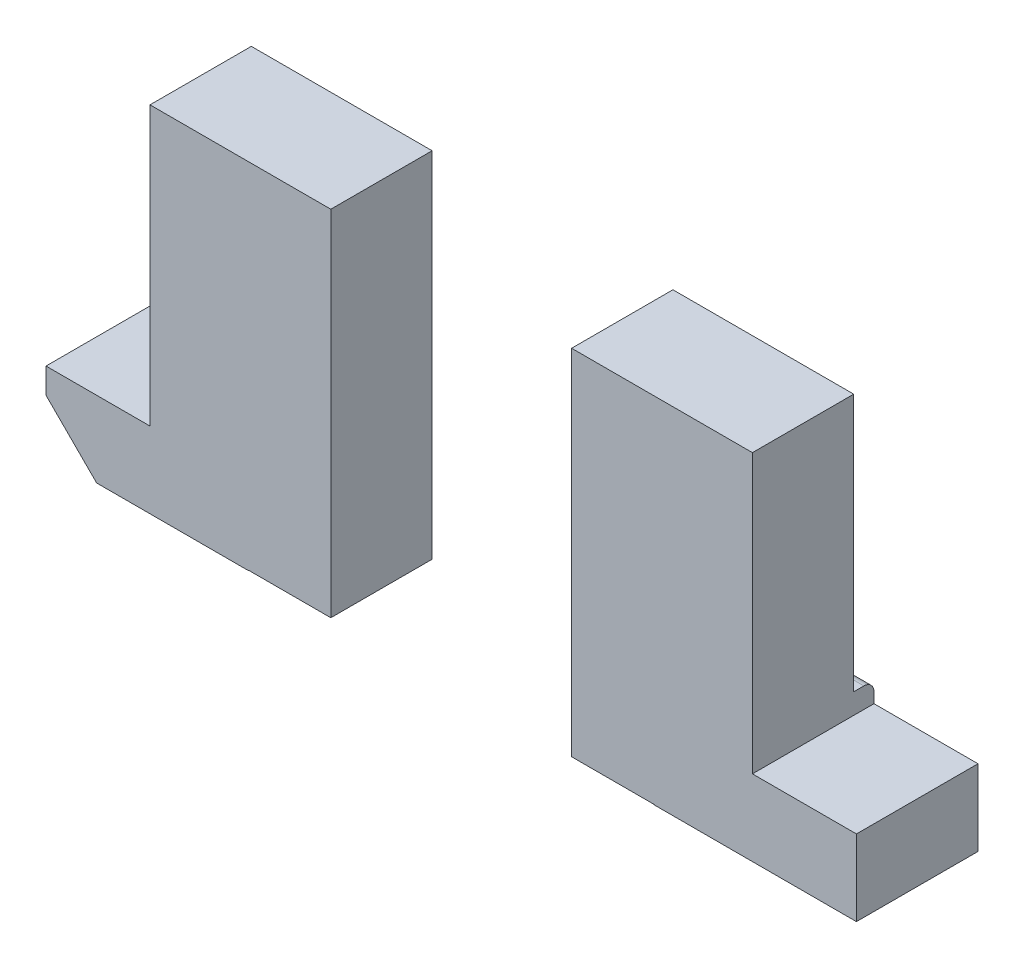
ISO-10303-21;
HEADER;
FILE_DESCRIPTION(('STEP AP214'),'2;1');
FILE_NAME('part.step','',(''),(''),'','','');
FILE_SCHEMA(('AUTOMOTIVE_DESIGN { 1 0 10303 214 1 1 1 1 }'));
ENDSEC;
DATA;
#1=APPLICATION_CONTEXT('core data for automotive mechanical design processes');
#2=APPLICATION_PROTOCOL_DEFINITION('international standard','automotive_design',2000,#1);
#3=PRODUCT_CONTEXT('',#1,'mechanical');
#4=PRODUCT('Part','Part','',(#3));
#5=PRODUCT_RELATED_PRODUCT_CATEGORY('part','',(#4));
#6=PRODUCT_DEFINITION_FORMATION('','',#4);
#7=PRODUCT_DEFINITION_CONTEXT('part definition',#1,'design');
#8=PRODUCT_DEFINITION('design','',#6,#7);
#9=PRODUCT_DEFINITION_SHAPE('','',#8);
#10=(LENGTH_UNIT() NAMED_UNIT(*) SI_UNIT(.MILLI.,.METRE.));
#11=(NAMED_UNIT(*) PLANE_ANGLE_UNIT() SI_UNIT($,.RADIAN.));
#12=(NAMED_UNIT(*) SI_UNIT($,.STERADIAN.) SOLID_ANGLE_UNIT());
#13=UNCERTAINTY_MEASURE_WITH_UNIT(LENGTH_MEASURE(1.E-05),#10,'distance_accuracy_value','');
#14=(GEOMETRIC_REPRESENTATION_CONTEXT(3) GLOBAL_UNCERTAINTY_ASSIGNED_CONTEXT((#13)) GLOBAL_UNIT_ASSIGNED_CONTEXT((#10,
#11,#12)) REPRESENTATION_CONTEXT('',''));
#15=CARTESIAN_POINT('',(0.,0.,0.));
#16=DIRECTION('',(0.,0.,1.));
#17=DIRECTION('',(1.,0.,0.));
#18=AXIS2_PLACEMENT_3D('',#15,#16,#17);
#19=CARTESIAN_POINT('',(-0.8,-0.2,0.));
#20=DIRECTION('',(0.,1.,0.));
#21=DIRECTION('',(1.,0.,0.));
#22=AXIS2_PLACEMENT_3D('',#19,#20,#21);
#23=PLANE('',#22);
#24=DIRECTION('',(1.,0.,0.));
#25=VECTOR('',#24,1.);
#26=CARTESIAN_POINT('',(0.,-0.2,0.02));
#27=LINE('',#26,#25);
#28=CARTESIAN_POINT('',(-0.8,-0.2,0.02));
#29=VERTEX_POINT('',#28);
#30=CARTESIAN_POINT('',(-0.594652416555,-0.2,0.02));
#31=VERTEX_POINT('',#30);
#32=EDGE_CURVE('P0_E237',#29,#31,#27,.T.);
#33=ORIENTED_EDGE('',*,*,#32,.F.);
#34=DIRECTION('',(0.,0.,-1.));
#35=VECTOR('',#34,1.);
#36=CARTESIAN_POINT('',(-0.8,-0.2,0.));
#37=LINE('',#36,#35);
#38=CARTESIAN_POINT('',(-0.8,-0.2,0.26));
#39=VERTEX_POINT('',#38);
#40=EDGE_CURVE('P0_E42',#39,#29,#37,.T.);
#41=ORIENTED_EDGE('',*,*,#40,.F.);
#42=DIRECTION('',(-1.,0.,0.));
#43=VECTOR('',#42,1.);
#44=CARTESIAN_POINT('',(0.,-0.2,0.26));
#45=LINE('',#44,#43);
#46=CARTESIAN_POINT('',(-0.594652416555,-0.2,0.26));
#47=VERTEX_POINT('',#46);
#48=EDGE_CURVE('P0_E227',#47,#39,#45,.T.);
#49=ORIENTED_EDGE('',*,*,#48,.F.);
#50=DIRECTION('',(0.,0.,1.));
#51=VECTOR('',#50,1.);
#52=CARTESIAN_POINT('',(-0.594652416555,-0.2,0.06885270012602));
#53=LINE('',#52,#51);
#54=EDGE_CURVE('P0_E28',#31,#47,#53,.T.);
#55=ORIENTED_EDGE('',*,*,#54,.F.);
#56=EDGE_LOOP('',(#33,#41,#49,#55));
#57=FACE_BOUND('',#56,.T.);
#58=ADVANCED_FACE('P0_F17',(#57),#23,.T.);
#59=CARTESIAN_POINT('',(-0.594652416555,-0.349252516346,0.26));
#60=DIRECTION('',(-1.,0.,0.));
#61=DIRECTION('',(0.,0.,1.));
#62=AXIS2_PLACEMENT_3D('',#59,#60,#61);
#63=PLANE('',#62);
#64=DIRECTION('',(0.,-1.,0.));
#65=VECTOR('',#64,1.);
#66=CARTESIAN_POINT('',(-0.594652416555,-0.129801770078,0.26));
#67=LINE('',#66,#65);
#68=CARTESIAN_POINT('',(-0.594652416555,0.349252516346,0.26));
#69=VERTEX_POINT('',#68);
#70=EDGE_CURVE('P0_E224',#69,#47,#67,.T.);
#71=ORIENTED_EDGE('',*,*,#70,.F.);
#72=DIRECTION('',(0.,0.,-1.));
#73=VECTOR('',#72,1.);
#74=CARTESIAN_POINT('',(-0.594652416555,0.349252516346,0.26));
#75=LINE('',#74,#73);
#76=CARTESIAN_POINT('',(-0.594652416555,0.349252516346,0.06));
#77=VERTEX_POINT('',#76);
#78=EDGE_CURVE('P0_E11',#69,#77,#75,.T.);
#79=ORIENTED_EDGE('',*,*,#78,.T.);
#80=DIRECTION('',(0.,1.,0.));
#81=VECTOR('',#80,1.);
#82=CARTESIAN_POINT('',(-0.594652416555,0.349252516346,0.06));
#83=LINE('',#82,#81);
#84=CARTESIAN_POINT('',(-0.594652416555,-0.159603540156,0.06));
#85=VERTEX_POINT('',#84);
#86=EDGE_CURVE('P0_E183',#85,#77,#83,.T.);
#87=ORIENTED_EDGE('',*,*,#86,.F.);
#88=DIRECTION('',(0.,0.,1.));
#89=VECTOR('',#88,1.);
#90=CARTESIAN_POINT('',(-0.594652416555,-0.159603540156,0.07885270012602));
#91=LINE('',#90,#89);
#92=CARTESIAN_POINT('',(-0.594652416555,-0.159603540156,0.04));
#93=VERTEX_POINT('',#92);
#94=EDGE_CURVE('P0_E206',#93,#85,#91,.T.);
#95=ORIENTED_EDGE('',*,*,#94,.F.);
#96=CARTESIAN_POINT('',(-0.594652416555,-0.179603540156,0.04));
#97=DIRECTION('',(1.,0.,0.));
#98=DIRECTION('',(0.,0.707106781186548,-0.707106781186548));
#99=AXIS2_PLACEMENT_3D('',#96,#97,#98);
#100=CIRCLE('',#99,0.02);
#101=CARTESIAN_POINT('',(-0.594652416555,-0.179603540156,0.02));
#102=VERTEX_POINT('',#101);
#103=EDGE_CURVE('P0_E217',#102,#93,#100,.T.);
#104=ORIENTED_EDGE('',*,*,#103,.F.);
#105=DIRECTION('',(0.,1.,0.));
#106=VECTOR('',#105,1.);
#107=CARTESIAN_POINT('',(-0.594652416555,-0.225,0.02));
#108=LINE('',#107,#106);
#109=EDGE_CURVE('P0_E125',#31,#102,#108,.T.);
#110=ORIENTED_EDGE('',*,*,#109,.F.);
#111=ORIENTED_EDGE('',*,*,#54,.T.);
#112=EDGE_LOOP('',(#71,#79,#87,#95,#104,#110,#111));
#113=FACE_BOUND('',#112,.T.);
#114=ADVANCED_FACE('P0_F285',(#113),#63,.T.);
#115=CARTESIAN_POINT('',(0.8,-0.159603540156,0.26));
#116=DIRECTION('',(0.,0.,1.));
#117=DIRECTION('',(1.,0.,0.));
#118=AXIS2_PLACEMENT_3D('',#115,#116,#117);
#119=PLANE('',#118);
#120=ORIENTED_EDGE('',*,*,#70,.T.);
#121=ORIENTED_EDGE('',*,*,#48,.T.);
#122=DIRECTION('',(0.,-1.,0.));
#123=VECTOR('',#122,1.);
#124=CARTESIAN_POINT('',(-0.8,0.2,0.26));
#125=LINE('',#124,#123);
#126=CARTESIAN_POINT('',(-0.8,-0.25,0.26));
#127=VERTEX_POINT('',#126);
#128=EDGE_CURVE('P0_E274',#39,#127,#125,.T.);
#129=ORIENTED_EDGE('',*,*,#128,.T.);
#130=DIRECTION('',(-0.707106781186548,0.707106781186548,0.));
#131=VECTOR('',#130,1.);
#132=CARTESIAN_POINT('',(-0.712899120865,-0.337100879135,0.26));
#133=LINE('',#132,#131);
#134=CARTESIAN_POINT('',(-0.7,-0.35,0.26));
#135=VERTEX_POINT('',#134);
#136=EDGE_CURVE('P0_E136',#135,#127,#133,.T.);
#137=ORIENTED_EDGE('',*,*,#136,.F.);
#138=DIRECTION('',(-1.,0.,0.));
#139=VECTOR('',#138,1.);
#140=CARTESIAN_POINT('',(-0.7,-0.35,0.26));
#141=LINE('',#140,#139);
#142=CARTESIAN_POINT('',(-0.4,-0.35,0.26));
#143=VERTEX_POINT('',#142);
#144=EDGE_CURVE('P0_E146',#143,#135,#141,.T.);
#145=ORIENTED_EDGE('',*,*,#144,.F.);
#146=DIRECTION('',(0.,1.,0.));
#147=VECTOR('',#146,1.);
#148=CARTESIAN_POINT('',(-0.4,0.172033539864,0.26));
#149=LINE('',#148,#147);
#150=CARTESIAN_POINT('',(-0.4,-0.349252516346,0.26));
#151=VERTEX_POINT('',#150);
#152=EDGE_CURVE('P0_E171',#143,#151,#149,.T.);
#153=ORIENTED_EDGE('',*,*,#152,.T.);
#154=DIRECTION('',(1.,0.,0.));
#155=VECTOR('',#154,1.);
#156=CARTESIAN_POINT('',(-0.594652416555,-0.349252516346,0.26));
#157=LINE('',#156,#155);
#158=CARTESIAN_POINT('',(-0.237707110887,-0.349252516346,0.26));
#159=VERTEX_POINT('',#158);
#160=EDGE_CURVE('P0_E164',#151,#159,#157,.T.);
#161=ORIENTED_EDGE('',*,*,#160,.T.);
#162=DIRECTION('',(0.,1.,0.));
#163=VECTOR('',#162,1.);
#164=CARTESIAN_POINT('',(-0.237707110887,-0.349252516346,0.26));
#165=LINE('',#164,#163);
#166=CARTESIAN_POINT('',(-0.237707110887,0.349252516346,0.26));
#167=VERTEX_POINT('',#166);
#168=EDGE_CURVE('P0_E156',#159,#167,#165,.T.);
#169=ORIENTED_EDGE('',*,*,#168,.T.);
#170=DIRECTION('',(-1.,0.,0.));
#171=VECTOR('',#170,1.);
#172=CARTESIAN_POINT('',(-0.237707110887,0.349252516346,0.26));
#173=LINE('',#172,#171);
#174=EDGE_CURVE('P0_E165',#167,#69,#173,.T.);
#175=ORIENTED_EDGE('',*,*,#174,.T.);
#176=EDGE_LOOP('',(#120,#121,#129,#137,#145,#153,#161,#169,#175));
#177=FACE_BOUND('',#176,.T.);
#178=ADVANCED_FACE('P0_F169',(#177),#119,.T.);
#179=CARTESIAN_POINT('',(-0.237707110887,-0.349252516346,0.26));
#180=DIRECTION('',(0.,-1.,0.));
#181=DIRECTION('',(0.,0.,-1.));
#182=AXIS2_PLACEMENT_3D('',#179,#180,#181);
#183=PLANE('',#182);
#184=DIRECTION('',(0.,0.,1.));
#185=VECTOR('',#184,1.);
#186=CARTESIAN_POINT('',(-0.4,-0.349252516346,0.13));
#187=LINE('',#186,#185);
#188=CARTESIAN_POINT('',(-0.4,-0.349252516346,0.06));
#189=VERTEX_POINT('',#188);
#190=EDGE_CURVE('P0_E67',#189,#151,#187,.T.);
#191=ORIENTED_EDGE('',*,*,#190,.F.);
#192=DIRECTION('',(-1.,0.,0.));
#193=VECTOR('',#192,1.);
#194=CARTESIAN_POINT('',(-0.594652416555,-0.349252516346,0.06));
#195=LINE('',#194,#193);
#196=CARTESIAN_POINT('',(-0.237707110887,-0.349252516346,0.06));
#197=VERTEX_POINT('',#196);
#198=EDGE_CURVE('P0_E21',#197,#189,#195,.T.);
#199=ORIENTED_EDGE('',*,*,#198,.F.);
#200=DIRECTION('',(0.,0.,-1.));
#201=VECTOR('',#200,1.);
#202=CARTESIAN_POINT('',(-0.237707110887,-0.349252516346,0.26));
#203=LINE('',#202,#201);
#204=EDGE_CURVE('P0_E159',#159,#197,#203,.T.);
#205=ORIENTED_EDGE('',*,*,#204,.F.);
#206=ORIENTED_EDGE('',*,*,#160,.F.);
#207=EDGE_LOOP('',(#191,#199,#205,#206));
#208=FACE_BOUND('',#207,.T.);
#209=ADVANCED_FACE('P0_F174',(#208),#183,.T.);
#210=CARTESIAN_POINT('',(-0.237707110887,0.349252516346,0.26));
#211=DIRECTION('',(1.,0.,0.));
#212=DIRECTION('',(0.,1.,0.));
#213=AXIS2_PLACEMENT_3D('',#210,#211,#212);
#214=PLANE('',#213);
#215=ORIENTED_EDGE('',*,*,#168,.F.);
#216=ORIENTED_EDGE('',*,*,#204,.T.);
#217=DIRECTION('',(0.,-1.,0.));
#218=VECTOR('',#217,1.);
#219=CARTESIAN_POINT('',(-0.237707110887,-0.349252516346,0.06));
#220=LINE('',#219,#218);
#221=CARTESIAN_POINT('',(-0.237707110887,0.349252516346,0.06));
#222=VERTEX_POINT('',#221);
#223=EDGE_CURVE('P0_E88',#222,#197,#220,.T.);
#224=ORIENTED_EDGE('',*,*,#223,.F.);
#225=DIRECTION('',(0.,0.,-1.));
#226=VECTOR('',#225,1.);
#227=CARTESIAN_POINT('',(-0.237707110887,0.349252516346,0.26));
#228=LINE('',#227,#226);
#229=EDGE_CURVE('P0_E160',#167,#222,#228,.T.);
#230=ORIENTED_EDGE('',*,*,#229,.F.);
#231=EDGE_LOOP('',(#215,#216,#224,#230));
#232=FACE_BOUND('',#231,.T.);
#233=ADVANCED_FACE('P0_F158',(#232),#214,.T.);
#234=CARTESIAN_POINT('',(-0.594652416555,0.349252516346,0.26));
#235=DIRECTION('',(0.,1.,0.));
#236=DIRECTION('',(1.,0.,0.));
#237=AXIS2_PLACEMENT_3D('',#234,#235,#236);
#238=PLANE('',#237);
#239=ORIENTED_EDGE('',*,*,#174,.F.);
#240=ORIENTED_EDGE('',*,*,#229,.T.);
#241=DIRECTION('',(1.,0.,0.));
#242=VECTOR('',#241,1.);
#243=CARTESIAN_POINT('',(-0.237707110887,0.349252516346,0.06));
#244=LINE('',#243,#242);
#245=EDGE_CURVE('P0_E187',#77,#222,#244,.T.);
#246=ORIENTED_EDGE('',*,*,#245,.F.);
#247=ORIENTED_EDGE('',*,*,#78,.F.);
#248=EDGE_LOOP('',(#239,#240,#246,#247));
#249=FACE_BOUND('',#248,.T.);
#250=ADVANCED_FACE('P0_F297',(#249),#238,.T.);
#251=CARTESIAN_POINT('',(-0.416179763721,0.,0.06));
#252=DIRECTION('',(0.,0.,-1.));
#253=DIRECTION('',(0.,-1.,0.));
#254=AXIS2_PLACEMENT_3D('',#251,#252,#253);
#255=PLANE('',#254);
#256=DIRECTION('',(1.,0.,0.));
#257=VECTOR('',#256,1.);
#258=CARTESIAN_POINT('',(0.19191011814,-0.159603540156,0.06));
#259=LINE('',#258,#257);
#260=CARTESIAN_POINT('',(-0.4,-0.159603540156,0.06));
#261=VERTEX_POINT('',#260);
#262=EDGE_CURVE('P0_E209',#85,#261,#259,.T.);
#263=ORIENTED_EDGE('',*,*,#262,.F.);
#264=ORIENTED_EDGE('',*,*,#86,.T.);
#265=ORIENTED_EDGE('',*,*,#245,.T.);
#266=ORIENTED_EDGE('',*,*,#223,.T.);
#267=ORIENTED_EDGE('',*,*,#198,.T.);
#268=DIRECTION('',(0.,-1.,0.));
#269=VECTOR('',#268,1.);
#270=CARTESIAN_POINT('',(-0.4,0.251835309942,0.06));
#271=LINE('',#270,#269);
#272=EDGE_CURVE('P0_E190',#261,#189,#271,.T.);
#273=ORIENTED_EDGE('',*,*,#272,.F.);
#274=EDGE_LOOP('',(#263,#264,#265,#266,#267,#273));
#275=FACE_BOUND('',#274,.T.);
#276=ADVANCED_FACE('P0_F291',(#275),#255,.T.);
#277=CARTESIAN_POINT('',(0.8,-0.159603540156,0.02));
#278=DIRECTION('',(0.,1.,0.));
#279=DIRECTION('',(1.,0.,0.));
#280=AXIS2_PLACEMENT_3D('',#277,#278,#279);
#281=PLANE('',#280);
#282=ORIENTED_EDGE('',*,*,#94,.T.);
#283=ORIENTED_EDGE('',*,*,#262,.T.);
#284=DIRECTION('',(0.,0.,-1.));
#285=VECTOR('',#284,1.);
#286=CARTESIAN_POINT('',(-0.4,-0.159603540156,0.));
#287=LINE('',#286,#285);
#288=CARTESIAN_POINT('',(-0.4,-0.159603540156,0.04));
#289=VERTEX_POINT('',#288);
#290=EDGE_CURVE('P0_E223',#261,#289,#287,.T.);
#291=ORIENTED_EDGE('',*,*,#290,.T.);
#292=DIRECTION('',(1.,0.,0.));
#293=VECTOR('',#292,1.);
#294=CARTESIAN_POINT('',(0.8,-0.159603540156,0.04));
#295=LINE('',#294,#293);
#296=EDGE_CURVE('P0_E215',#93,#289,#295,.T.);
#297=ORIENTED_EDGE('',*,*,#296,.F.);
#298=EDGE_LOOP('',(#282,#283,#291,#297));
#299=FACE_BOUND('',#298,.T.);
#300=ADVANCED_FACE('P0_F289',(#299),#281,.T.);
#301=CARTESIAN_POINT('',(-0.4,0.503670619885,0.));
#302=DIRECTION('',(-1.,0.,0.));
#303=DIRECTION('',(0.,0.,1.));
#304=AXIS2_PLACEMENT_3D('',#301,#302,#303);
#305=PLANE('',#304);
#306=ORIENTED_EDGE('',*,*,#272,.T.);
#307=ORIENTED_EDGE('',*,*,#190,.T.);
#308=ORIENTED_EDGE('',*,*,#152,.F.);
#309=DIRECTION('',(0.,0.,-1.));
#310=VECTOR('',#309,1.);
#311=CARTESIAN_POINT('',(-0.4,-0.35,0.));
#312=LINE('',#311,#310);
#313=CARTESIAN_POINT('',(-0.4,-0.35,0.02));
#314=VERTEX_POINT('',#313);
#315=EDGE_CURVE('P0_E191',#143,#314,#312,.T.);
#316=ORIENTED_EDGE('',*,*,#315,.T.);
#317=DIRECTION('',(0.,-1.,0.));
#318=VECTOR('',#317,1.);
#319=CARTESIAN_POINT('',(-0.4,0.07683530994244,0.02));
#320=LINE('',#319,#318);
#321=CARTESIAN_POINT('',(-0.4,-0.179603540156,0.02));
#322=VERTEX_POINT('',#321);
#323=EDGE_CURVE('P0_E198',#322,#314,#320,.T.);
#324=ORIENTED_EDGE('',*,*,#323,.F.);
#325=CARTESIAN_POINT('',(-0.4,-0.179603540156,0.04));
#326=DIRECTION('',(-1.,0.,0.));
#327=DIRECTION('',(0.,0.707106781186548,-0.707106781186548));
#328=AXIS2_PLACEMENT_3D('',#325,#326,#327);
#329=CIRCLE('',#328,0.02);
#330=EDGE_CURVE('P0_E218',#289,#322,#329,.T.);
#331=ORIENTED_EDGE('',*,*,#330,.F.);
#332=ORIENTED_EDGE('',*,*,#290,.F.);
#333=EDGE_LOOP('',(#306,#307,#308,#316,#324,#331,#332));
#334=FACE_BOUND('',#333,.T.);
#335=ADVANCED_FACE('P0_F252',(#334),#305,.F.);
#336=CARTESIAN_POINT('',(0.8,-0.179603540156,0.04));
#337=DIRECTION('',(1.,0.,0.));
#338=DIRECTION('',(0.,0.707106781186548,-0.707106781186548));
#339=AXIS2_PLACEMENT_3D('',#336,#337,#338);
#340=CYLINDRICAL_SURFACE('',#339,0.02);
#341=ORIENTED_EDGE('',*,*,#103,.T.);
#342=ORIENTED_EDGE('',*,*,#296,.T.);
#343=ORIENTED_EDGE('',*,*,#330,.T.);
#344=DIRECTION('',(-1.,0.,0.));
#345=VECTOR('',#344,1.);
#346=CARTESIAN_POINT('',(0.8,-0.179603540156,0.02));
#347=LINE('',#346,#345);
#348=EDGE_CURVE('P0_E228',#322,#102,#347,.T.);
#349=ORIENTED_EDGE('',*,*,#348,.T.);
#350=EDGE_LOOP('',(#341,#342,#343,#349));
#351=FACE_BOUND('',#350,.T.);
#352=ADVANCED_FACE('P0_F244',(#351),#340,.T.);
#353=CARTESIAN_POINT('',(0.8,-0.35,0.02));
#354=DIRECTION('',(0.,0.,-1.));
#355=DIRECTION('',(0.,-1.,0.));
#356=AXIS2_PLACEMENT_3D('',#353,#354,#355);
#357=PLANE('',#356);
#358=ORIENTED_EDGE('',*,*,#109,.T.);
#359=ORIENTED_EDGE('',*,*,#348,.F.);
#360=ORIENTED_EDGE('',*,*,#323,.T.);
#361=DIRECTION('',(-1.,0.,0.));
#362=VECTOR('',#361,1.);
#363=CARTESIAN_POINT('',(0.,-0.35,0.02));
#364=LINE('',#363,#362);
#365=CARTESIAN_POINT('',(-0.7,-0.35,0.02));
#366=VERTEX_POINT('',#365);
#367=EDGE_CURVE('P0_E196',#314,#366,#364,.T.);
#368=ORIENTED_EDGE('',*,*,#367,.T.);
#369=DIRECTION('',(-0.707106781186548,0.707106781186548,0.));
#370=VECTOR('',#369,1.);
#371=CARTESIAN_POINT('',(-0.35,-0.7,0.02));
#372=LINE('',#371,#370);
#373=CARTESIAN_POINT('',(-0.8,-0.25,0.02));
#374=VERTEX_POINT('',#373);
#375=EDGE_CURVE('P0_E192',#366,#374,#372,.T.);
#376=ORIENTED_EDGE('',*,*,#375,.T.);
#377=DIRECTION('',(0.,1.,0.));
#378=VECTOR('',#377,1.);
#379=CARTESIAN_POINT('',(-0.8,0.025,0.02));
#380=LINE('',#379,#378);
#381=EDGE_CURVE('P0_E197',#374,#29,#380,.T.);
#382=ORIENTED_EDGE('',*,*,#381,.T.);
#383=ORIENTED_EDGE('',*,*,#32,.T.);
#384=EDGE_LOOP('',(#358,#359,#360,#368,#376,#382,#383));
#385=FACE_BOUND('',#384,.T.);
#386=ADVANCED_FACE('P0_F249',(#385),#357,.T.);
#387=CARTESIAN_POINT('',(-0.75,-0.3,0.));
#388=DIRECTION('',(-0.707106781186548,-0.707106781186548,0.));
#389=DIRECTION('',(-0.707106781186548,0.707106781186548,0.));
#390=AXIS2_PLACEMENT_3D('',#387,#388,#389);
#391=PLANE('',#390);
#392=ORIENTED_EDGE('',*,*,#375,.F.);
#393=DIRECTION('',(0.,0.,1.));
#394=VECTOR('',#393,1.);
#395=CARTESIAN_POINT('',(-0.7,-0.35,0.));
#396=LINE('',#395,#394);
#397=EDGE_CURVE('P0_E256',#366,#135,#396,.T.);
#398=ORIENTED_EDGE('',*,*,#397,.T.);
#399=ORIENTED_EDGE('',*,*,#136,.T.);
#400=DIRECTION('',(0.,0.,-1.));
#401=VECTOR('',#400,1.);
#402=CARTESIAN_POINT('',(-0.8,-0.25,0.));
#403=LINE('',#402,#401);
#404=EDGE_CURVE('P0_E202',#127,#374,#403,.T.);
#405=ORIENTED_EDGE('',*,*,#404,.T.);
#406=EDGE_LOOP('',(#392,#398,#399,#405));
#407=FACE_BOUND('',#406,.T.);
#408=ADVANCED_FACE('P0_F318',(#407),#391,.T.);
#409=CARTESIAN_POINT('',(-0.8,0.4,0.));
#410=DIRECTION('',(-1.,0.,0.));
#411=DIRECTION('',(0.,0.,1.));
#412=AXIS2_PLACEMENT_3D('',#409,#410,#411);
#413=PLANE('',#412);
#414=ORIENTED_EDGE('',*,*,#40,.T.);
#415=ORIENTED_EDGE('',*,*,#381,.F.);
#416=ORIENTED_EDGE('',*,*,#404,.F.);
#417=ORIENTED_EDGE('',*,*,#128,.F.);
#418=EDGE_LOOP('',(#414,#415,#416,#417));
#419=FACE_BOUND('',#418,.T.);
#420=ADVANCED_FACE('P0_F19',(#419),#413,.T.);
#421=CARTESIAN_POINT('',(-0.8,-0.35,0.));
#422=DIRECTION('',(0.,-1.,0.));
#423=DIRECTION('',(0.,0.,-1.));
#424=AXIS2_PLACEMENT_3D('',#421,#422,#423);
#425=PLANE('',#424);
#426=ORIENTED_EDGE('',*,*,#367,.F.);
#427=ORIENTED_EDGE('',*,*,#315,.F.);
#428=ORIENTED_EDGE('',*,*,#144,.T.);
#429=ORIENTED_EDGE('',*,*,#397,.F.);
#430=EDGE_LOOP('',(#426,#427,#428,#429));
#431=FACE_BOUND('',#430,.T.);
#432=ADVANCED_FACE('P0_F255',(#431),#425,.T.);
#433=CLOSED_SHELL('',(#58,#114,#178,#209,#233,#250,#276,#300,#335,#352,#386,#408,#420,#432));
#434=MANIFOLD_SOLID_BREP('P0_B1',#433);
#435=CARTESIAN_POINT('',(0.8,-0.2,0.));
#436=DIRECTION('',(0.,-1.,0.));
#437=DIRECTION('',(0.,0.,-1.));
#438=AXIS2_PLACEMENT_3D('',#435,#436,#437);
#439=PLANE('',#438);
#440=DIRECTION('',(-1.,0.,0.));
#441=VECTOR('',#440,1.);
#442=CARTESIAN_POINT('',(0.8,-0.2,0.26));
#443=LINE('',#442,#441);
#444=CARTESIAN_POINT('',(0.8,-0.2,0.26));
#445=VERTEX_POINT('',#444);
#446=CARTESIAN_POINT('',(0.594652416555,-0.2,0.26));
#447=VERTEX_POINT('',#446);
#448=EDGE_CURVE('P1_E41',#445,#447,#443,.T.);
#449=ORIENTED_EDGE('',*,*,#448,.F.);
#450=DIRECTION('',(0.,0.,1.));
#451=VECTOR('',#450,1.);
#452=CARTESIAN_POINT('',(0.8,-0.2,0.));
#453=LINE('',#452,#451);
#454=CARTESIAN_POINT('',(0.8,-0.2,0.02));
#455=VERTEX_POINT('',#454);
#456=EDGE_CURVE('P1_E178',#455,#445,#453,.T.);
#457=ORIENTED_EDGE('',*,*,#456,.F.);
#458=DIRECTION('',(1.,0.,0.));
#459=VECTOR('',#458,1.);
#460=CARTESIAN_POINT('',(0.8,-0.2,0.02));
#461=LINE('',#460,#459);
#462=CARTESIAN_POINT('',(0.594652416555,-0.2,0.02));
#463=VERTEX_POINT('',#462);
#464=EDGE_CURVE('P1_E151',#463,#455,#461,.T.);
#465=ORIENTED_EDGE('',*,*,#464,.F.);
#466=DIRECTION('',(0.,0.,1.));
#467=VECTOR('',#466,1.);
#468=CARTESIAN_POINT('',(0.594652416555,-0.2,0.06885270012602));
#469=LINE('',#468,#467);
#470=EDGE_CURVE('P1_E11',#463,#447,#469,.T.);
#471=ORIENTED_EDGE('',*,*,#470,.T.);
#472=EDGE_LOOP('',(#449,#457,#465,#471));
#473=FACE_BOUND('',#472,.T.);
#474=ADVANCED_FACE('P1_F17',(#473),#439,.F.);
#475=CARTESIAN_POINT('',(0.8,-0.159603540156,0.02));
#476=DIRECTION('',(0.,1.,0.));
#477=DIRECTION('',(1.,0.,0.));
#478=AXIS2_PLACEMENT_3D('',#475,#476,#477);
#479=PLANE('',#478);
#480=DIRECTION('',(0.,0.,-1.));
#481=VECTOR('',#480,1.);
#482=CARTESIAN_POINT('',(0.594652416555,-0.159603540156,0.07885270012602));
#483=LINE('',#482,#481);
#484=CARTESIAN_POINT('',(0.594652416555,-0.159603540156,0.06));
#485=VERTEX_POINT('',#484);
#486=CARTESIAN_POINT('',(0.594652416555,-0.159603540156,0.04));
#487=VERTEX_POINT('',#486);
#488=EDGE_CURVE('P1_E28',#485,#487,#483,.T.);
#489=ORIENTED_EDGE('',*,*,#488,.T.);
#490=DIRECTION('',(1.,0.,0.));
#491=VECTOR('',#490,1.);
#492=CARTESIAN_POINT('',(0.8,-0.159603540156,0.04));
#493=LINE('',#492,#491);
#494=CARTESIAN_POINT('',(0.4,-0.159603540156,0.04));
#495=VERTEX_POINT('',#494);
#496=EDGE_CURVE('P1_E184',#495,#487,#493,.T.);
#497=ORIENTED_EDGE('',*,*,#496,.F.);
#498=DIRECTION('',(0.,0.,1.));
#499=VECTOR('',#498,1.);
#500=CARTESIAN_POINT('',(0.4,-0.159603540156,0.01));
#501=LINE('',#500,#499);
#502=CARTESIAN_POINT('',(0.4,-0.159603540156,0.06));
#503=VERTEX_POINT('',#502);
#504=EDGE_CURVE('P1_E147',#495,#503,#501,.T.);
#505=ORIENTED_EDGE('',*,*,#504,.T.);
#506=DIRECTION('',(1.,0.,0.));
#507=VECTOR('',#506,1.);
#508=CARTESIAN_POINT('',(0.60808988186,-0.159603540156,0.06));
#509=LINE('',#508,#507);
#510=EDGE_CURVE('P1_E150',#503,#485,#509,.T.);
#511=ORIENTED_EDGE('',*,*,#510,.T.);
#512=EDGE_LOOP('',(#489,#497,#505,#511));
#513=FACE_BOUND('',#512,.T.);
#514=ADVANCED_FACE('P1_F287',(#513),#479,.T.);
#515=CARTESIAN_POINT('',(0.8,-0.179603540156,0.04));
#516=DIRECTION('',(1.,0.,0.));
#517=DIRECTION('',(0.,0.707106781186548,-0.707106781186548));
#518=AXIS2_PLACEMENT_3D('',#515,#516,#517);
#519=CYLINDRICAL_SURFACE('',#518,0.02);
#520=CARTESIAN_POINT('',(0.594652416555,-0.179603540156,0.04));
#521=DIRECTION('',(-1.,0.,0.));
#522=DIRECTION('',(0.,0.707106781186548,-0.707106781186548));
#523=AXIS2_PLACEMENT_3D('',#520,#521,#522);
#524=CIRCLE('',#523,0.02);
#525=CARTESIAN_POINT('',(0.594652416555,-0.179603540156,0.02));
#526=VERTEX_POINT('',#525);
#527=EDGE_CURVE('P1_E202',#487,#526,#524,.T.);
#528=ORIENTED_EDGE('',*,*,#527,.T.);
#529=DIRECTION('',(-1.,0.,0.));
#530=VECTOR('',#529,1.);
#531=CARTESIAN_POINT('',(0.8,-0.179603540156,0.02));
#532=LINE('',#531,#530);
#533=CARTESIAN_POINT('',(0.4,-0.179603540156,0.02));
#534=VERTEX_POINT('',#533);
#535=EDGE_CURVE('P1_E183',#526,#534,#532,.T.);
#536=ORIENTED_EDGE('',*,*,#535,.T.);
#537=CARTESIAN_POINT('',(0.4,-0.179603540156,0.04));
#538=DIRECTION('',(1.,0.,0.));
#539=DIRECTION('',(0.,0.707106781186548,-0.707106781186548));
#540=AXIS2_PLACEMENT_3D('',#537,#538,#539);
#541=CIRCLE('',#540,0.02);
#542=EDGE_CURVE('P1_E179',#534,#495,#541,.T.);
#543=ORIENTED_EDGE('',*,*,#542,.T.);
#544=ORIENTED_EDGE('',*,*,#496,.T.);
#545=EDGE_LOOP('',(#528,#536,#543,#544));
#546=FACE_BOUND('',#545,.T.);
#547=ADVANCED_FACE('P1_F261',(#546),#519,.T.);
#548=CARTESIAN_POINT('',(0.8,-0.35,0.02));
#549=DIRECTION('',(0.,0.,-1.));
#550=DIRECTION('',(0.,-1.,0.));
#551=AXIS2_PLACEMENT_3D('',#548,#549,#550);
#552=PLANE('',#551);
#553=DIRECTION('',(0.,-1.,0.));
#554=VECTOR('',#553,1.);
#555=CARTESIAN_POINT('',(0.594652416555,-0.225,0.02));
#556=LINE('',#555,#554);
#557=EDGE_CURVE('P1_E155',#526,#463,#556,.T.);
#558=ORIENTED_EDGE('',*,*,#557,.T.);
#559=ORIENTED_EDGE('',*,*,#464,.T.);
#560=DIRECTION('',(0.,-1.,0.));
#561=VECTOR('',#560,1.);
#562=CARTESIAN_POINT('',(0.8,-0.375,0.02));
#563=LINE('',#562,#561);
#564=CARTESIAN_POINT('',(0.8,-0.35,0.02));
#565=VERTEX_POINT('',#564);
#566=EDGE_CURVE('P1_E156',#455,#565,#563,.T.);
#567=ORIENTED_EDGE('',*,*,#566,.T.);
#568=DIRECTION('',(-1.,0.,0.));
#569=VECTOR('',#568,1.);
#570=CARTESIAN_POINT('',(0.,-0.35,0.02));
#571=LINE('',#570,#569);
#572=CARTESIAN_POINT('',(0.4,-0.35,0.02));
#573=VERTEX_POINT('',#572);
#574=EDGE_CURVE('P1_E174',#565,#573,#571,.T.);
#575=ORIENTED_EDGE('',*,*,#574,.T.);
#576=DIRECTION('',(0.,1.,0.));
#577=VECTOR('',#576,1.);
#578=CARTESIAN_POINT('',(0.4,-0.426835309942,0.02));
#579=LINE('',#578,#577);
#580=EDGE_CURVE('P1_E208',#573,#534,#579,.T.);
#581=ORIENTED_EDGE('',*,*,#580,.T.);
#582=ORIENTED_EDGE('',*,*,#535,.F.);
#583=EDGE_LOOP('',(#558,#559,#567,#575,#581,#582));
#584=FACE_BOUND('',#583,.T.);
#585=ADVANCED_FACE('P1_F264',(#584),#552,.T.);
#586=CARTESIAN_POINT('',(0.237707110887,-0.349252516346,0.26));
#587=DIRECTION('',(0.,1.,0.));
#588=DIRECTION('',(1.,0.,0.));
#589=AXIS2_PLACEMENT_3D('',#586,#587,#588);
#590=PLANE('',#589);
#591=DIRECTION('',(0.,0.,-1.));
#592=VECTOR('',#591,1.);
#593=CARTESIAN_POINT('',(0.4,-0.349252516346,0.13));
#594=LINE('',#593,#592);
#595=CARTESIAN_POINT('',(0.4,-0.349252516346,0.26));
#596=VERTEX_POINT('',#595);
#597=CARTESIAN_POINT('',(0.4,-0.349252516346,0.06));
#598=VERTEX_POINT('',#597);
#599=EDGE_CURVE('P1_E136',#596,#598,#594,.T.);
#600=ORIENTED_EDGE('',*,*,#599,.F.);
#601=DIRECTION('',(-1.,0.,0.));
#602=VECTOR('',#601,1.);
#603=CARTESIAN_POINT('',(0.594652416555,-0.349252516346,0.26));
#604=LINE('',#603,#602);
#605=CARTESIAN_POINT('',(0.237707110887,-0.349252516346,0.26));
#606=VERTEX_POINT('',#605);
#607=EDGE_CURVE('P1_E197',#596,#606,#604,.T.);
#608=ORIENTED_EDGE('',*,*,#607,.T.);
#609=DIRECTION('',(0.,0.,-1.));
#610=VECTOR('',#609,1.);
#611=CARTESIAN_POINT('',(0.237707110887,-0.349252516346,0.26));
#612=LINE('',#611,#610);
#613=CARTESIAN_POINT('',(0.237707110887,-0.349252516346,0.06));
#614=VERTEX_POINT('',#613);
#615=EDGE_CURVE('P1_E195',#606,#614,#612,.T.);
#616=ORIENTED_EDGE('',*,*,#615,.T.);
#617=DIRECTION('',(1.,0.,0.));
#618=VECTOR('',#617,1.);
#619=CARTESIAN_POINT('',(0.594652416555,-0.349252516346,0.06));
#620=LINE('',#619,#618);
#621=EDGE_CURVE('P1_E120',#614,#598,#620,.T.);
#622=ORIENTED_EDGE('',*,*,#621,.T.);
#623=EDGE_LOOP('',(#600,#608,#616,#622));
#624=FACE_BOUND('',#623,.T.);
#625=ADVANCED_FACE('P1_F19',(#624),#590,.F.);
#626=CARTESIAN_POINT('',(0.594652416555,-0.349252516346,0.26));
#627=DIRECTION('',(-1.,0.,0.));
#628=DIRECTION('',(0.,0.,1.));
#629=AXIS2_PLACEMENT_3D('',#626,#627,#628);
#630=PLANE('',#629);
#631=DIRECTION('',(0.,1.,0.));
#632=VECTOR('',#631,1.);
#633=CARTESIAN_POINT('',(0.594652416555,0.349252516346,0.06));
#634=LINE('',#633,#632);
#635=CARTESIAN_POINT('',(0.594652416555,0.349252516346,0.06));
#636=VERTEX_POINT('',#635);
#637=EDGE_CURVE('P1_E192',#485,#636,#634,.T.);
#638=ORIENTED_EDGE('',*,*,#637,.T.);
#639=DIRECTION('',(0.,0.,-1.));
#640=VECTOR('',#639,1.);
#641=CARTESIAN_POINT('',(0.594652416555,0.349252516346,0.26));
#642=LINE('',#641,#640);
#643=CARTESIAN_POINT('',(0.594652416555,0.349252516346,0.26));
#644=VERTEX_POINT('',#643);
#645=EDGE_CURVE('P1_E21',#644,#636,#642,.T.);
#646=ORIENTED_EDGE('',*,*,#645,.F.);
#647=DIRECTION('',(0.,1.,0.));
#648=VECTOR('',#647,1.);
#649=CARTESIAN_POINT('',(0.594652416555,-0.129801770078,0.26));
#650=LINE('',#649,#648);
#651=EDGE_CURVE('P1_E161',#447,#644,#650,.T.);
#652=ORIENTED_EDGE('',*,*,#651,.F.);
#653=ORIENTED_EDGE('',*,*,#470,.F.);
#654=ORIENTED_EDGE('',*,*,#557,.F.);
#655=ORIENTED_EDGE('',*,*,#527,.F.);
#656=ORIENTED_EDGE('',*,*,#488,.F.);
#657=EDGE_LOOP('',(#638,#646,#652,#653,#654,#655,#656));
#658=FACE_BOUND('',#657,.T.);
#659=ADVANCED_FACE('P1_F278',(#658),#630,.F.);
#660=CARTESIAN_POINT('',(0.237707110887,0.349252516346,0.26));
#661=DIRECTION('',(1.,0.,0.));
#662=DIRECTION('',(0.,1.,0.));
#663=AXIS2_PLACEMENT_3D('',#660,#661,#662);
#664=PLANE('',#663);
#665=DIRECTION('',(0.,1.,0.));
#666=VECTOR('',#665,1.);
#667=CARTESIAN_POINT('',(0.237707110887,-0.349252516346,0.26));
#668=LINE('',#667,#666);
#669=CARTESIAN_POINT('',(0.237707110887,0.349252516346,0.26));
#670=VERTEX_POINT('',#669);
#671=EDGE_CURVE('P1_E128',#606,#670,#668,.T.);
#672=ORIENTED_EDGE('',*,*,#671,.T.);
#673=DIRECTION('',(0.,0.,-1.));
#674=VECTOR('',#673,1.);
#675=CARTESIAN_POINT('',(0.237707110887,0.349252516346,0.26));
#676=LINE('',#675,#674);
#677=CARTESIAN_POINT('',(0.237707110887,0.349252516346,0.06));
#678=VERTEX_POINT('',#677);
#679=EDGE_CURVE('P1_E106',#670,#678,#676,.T.);
#680=ORIENTED_EDGE('',*,*,#679,.T.);
#681=DIRECTION('',(0.,-1.,0.));
#682=VECTOR('',#681,1.);
#683=CARTESIAN_POINT('',(0.237707110887,-0.349252516346,0.06));
#684=LINE('',#683,#682);
#685=EDGE_CURVE('P1_E114',#678,#614,#684,.T.);
#686=ORIENTED_EDGE('',*,*,#685,.T.);
#687=ORIENTED_EDGE('',*,*,#615,.F.);
#688=EDGE_LOOP('',(#672,#680,#686,#687));
#689=FACE_BOUND('',#688,.T.);
#690=ADVANCED_FACE('P1_F126',(#689),#664,.F.);
#691=CARTESIAN_POINT('',(0.594652416555,0.349252516346,0.26));
#692=DIRECTION('',(0.,-1.,0.));
#693=DIRECTION('',(0.,0.,-1.));
#694=AXIS2_PLACEMENT_3D('',#691,#692,#693);
#695=PLANE('',#694);
#696=DIRECTION('',(1.,0.,0.));
#697=VECTOR('',#696,1.);
#698=CARTESIAN_POINT('',(0.237707110887,0.349252516346,0.26));
#699=LINE('',#698,#697);
#700=EDGE_CURVE('P1_E124',#670,#644,#699,.T.);
#701=ORIENTED_EDGE('',*,*,#700,.T.);
#702=ORIENTED_EDGE('',*,*,#645,.T.);
#703=DIRECTION('',(-1.,0.,0.));
#704=VECTOR('',#703,1.);
#705=CARTESIAN_POINT('',(0.237707110887,0.349252516346,0.06));
#706=LINE('',#705,#704);
#707=EDGE_CURVE('P1_E118',#636,#678,#706,.T.);
#708=ORIENTED_EDGE('',*,*,#707,.T.);
#709=ORIENTED_EDGE('',*,*,#679,.F.);
#710=EDGE_LOOP('',(#701,#702,#708,#709));
#711=FACE_BOUND('',#710,.T.);
#712=ADVANCED_FACE('P1_F132',(#711),#695,.F.);
#713=CARTESIAN_POINT('',(0.416179763721,0.,0.06));
#714=DIRECTION('',(0.,0.,1.));
#715=DIRECTION('',(1.,0.,0.));
#716=AXIS2_PLACEMENT_3D('',#713,#714,#715);
#717=PLANE('',#716);
#718=DIRECTION('',(0.,1.,0.));
#719=VECTOR('',#718,1.);
#720=CARTESIAN_POINT('',(0.4,-0.251835309942,0.06));
#721=LINE('',#720,#719);
#722=EDGE_CURVE('P1_E143',#598,#503,#721,.T.);
#723=ORIENTED_EDGE('',*,*,#722,.F.);
#724=ORIENTED_EDGE('',*,*,#621,.F.);
#725=ORIENTED_EDGE('',*,*,#685,.F.);
#726=ORIENTED_EDGE('',*,*,#707,.F.);
#727=ORIENTED_EDGE('',*,*,#637,.F.);
#728=ORIENTED_EDGE('',*,*,#510,.F.);
#729=EDGE_LOOP('',(#723,#724,#725,#726,#727,#728));
#730=FACE_BOUND('',#729,.T.);
#731=ADVANCED_FACE('P1_F116',(#730),#717,.F.);
#732=CARTESIAN_POINT('',(0.4,-0.503670619885,0.));
#733=DIRECTION('',(1.,0.,0.));
#734=DIRECTION('',(0.,1.,0.));
#735=AXIS2_PLACEMENT_3D('',#732,#733,#734);
#736=PLANE('',#735);
#737=ORIENTED_EDGE('',*,*,#599,.T.);
#738=ORIENTED_EDGE('',*,*,#722,.T.);
#739=ORIENTED_EDGE('',*,*,#504,.F.);
#740=ORIENTED_EDGE('',*,*,#542,.F.);
#741=ORIENTED_EDGE('',*,*,#580,.F.);
#742=DIRECTION('',(0.,0.,-1.));
#743=VECTOR('',#742,1.);
#744=CARTESIAN_POINT('',(0.4,-0.35,0.));
#745=LINE('',#744,#743);
#746=CARTESIAN_POINT('',(0.4,-0.35,0.26));
#747=VERTEX_POINT('',#746);
#748=EDGE_CURVE('P1_E163',#747,#573,#745,.T.);
#749=ORIENTED_EDGE('',*,*,#748,.F.);
#750=DIRECTION('',(0.,-1.,0.));
#751=VECTOR('',#750,1.);
#752=CARTESIAN_POINT('',(0.4,-0.331637080021,0.26));
#753=LINE('',#752,#751);
#754=EDGE_CURVE('P1_E157',#596,#747,#753,.T.);
#755=ORIENTED_EDGE('',*,*,#754,.F.);
#756=EDGE_LOOP('',(#737,#738,#739,#740,#741,#749,#755));
#757=FACE_BOUND('',#756,.T.);
#758=ADVANCED_FACE('P1_F233',(#757),#736,.F.);
#759=CARTESIAN_POINT('',(0.8,-0.4,0.));
#760=DIRECTION('',(1.,0.,0.));
#761=DIRECTION('',(0.,1.,0.));
#762=AXIS2_PLACEMENT_3D('',#759,#760,#761);
#763=PLANE('',#762);
#764=ORIENTED_EDGE('',*,*,#456,.T.);
#765=DIRECTION('',(0.,1.,0.));
#766=VECTOR('',#765,1.);
#767=CARTESIAN_POINT('',(0.8,-0.2,0.26));
#768=LINE('',#767,#766);
#769=CARTESIAN_POINT('',(0.8,-0.35,0.26));
#770=VERTEX_POINT('',#769);
#771=EDGE_CURVE('P1_E162',#770,#445,#768,.T.);
#772=ORIENTED_EDGE('',*,*,#771,.F.);
#773=DIRECTION('',(0.,0.,1.));
#774=VECTOR('',#773,1.);
#775=CARTESIAN_POINT('',(0.8,-0.35,0.));
#776=LINE('',#775,#774);
#777=EDGE_CURVE('P1_E188',#565,#770,#776,.T.);
#778=ORIENTED_EDGE('',*,*,#777,.F.);
#779=ORIENTED_EDGE('',*,*,#566,.F.);
#780=EDGE_LOOP('',(#764,#772,#778,#779));
#781=FACE_BOUND('',#780,.T.);
#782=ADVANCED_FACE('P1_F246',(#781),#763,.T.);
#783=CARTESIAN_POINT('',(0.8,-0.159603540156,0.26));
#784=DIRECTION('',(0.,0.,1.));
#785=DIRECTION('',(1.,0.,0.));
#786=AXIS2_PLACEMENT_3D('',#783,#784,#785);
#787=PLANE('',#786);
#788=ORIENTED_EDGE('',*,*,#651,.T.);
#789=ORIENTED_EDGE('',*,*,#700,.F.);
#790=ORIENTED_EDGE('',*,*,#671,.F.);
#791=ORIENTED_EDGE('',*,*,#607,.F.);
#792=ORIENTED_EDGE('',*,*,#754,.T.);
#793=DIRECTION('',(-1.,0.,0.));
#794=VECTOR('',#793,1.);
#795=CARTESIAN_POINT('',(-0.1,-0.35,0.26));
#796=LINE('',#795,#794);
#797=EDGE_CURVE('P1_E167',#770,#747,#796,.T.);
#798=ORIENTED_EDGE('',*,*,#797,.F.);
#799=ORIENTED_EDGE('',*,*,#771,.T.);
#800=ORIENTED_EDGE('',*,*,#448,.T.);
#801=EDGE_LOOP('',(#788,#789,#790,#791,#792,#798,#799,#800));
#802=FACE_BOUND('',#801,.T.);
#803=ADVANCED_FACE('P1_F237',(#802),#787,.T.);
#804=CARTESIAN_POINT('',(-0.8,-0.35,0.));
#805=DIRECTION('',(0.,-1.,0.));
#806=DIRECTION('',(0.,0.,-1.));
#807=AXIS2_PLACEMENT_3D('',#804,#805,#806);
#808=PLANE('',#807);
#809=ORIENTED_EDGE('',*,*,#574,.F.);
#810=ORIENTED_EDGE('',*,*,#777,.T.);
#811=ORIENTED_EDGE('',*,*,#797,.T.);
#812=ORIENTED_EDGE('',*,*,#748,.T.);
#813=EDGE_LOOP('',(#809,#810,#811,#812));
#814=FACE_BOUND('',#813,.T.);
#815=ADVANCED_FACE('P1_F241',(#814),#808,.T.);
#816=CLOSED_SHELL('',(#474,#514,#547,#585,#625,#659,#690,#712,#731,#758,#782,#803,#815));
#817=MANIFOLD_SOLID_BREP('P1_B1',#816);
#818=ADVANCED_BREP_SHAPE_REPRESENTATION('',(#18,#434,#817),#14);
#819=SHAPE_DEFINITION_REPRESENTATION(#9,#818);
ENDSEC;
END-ISO-10303-21;
